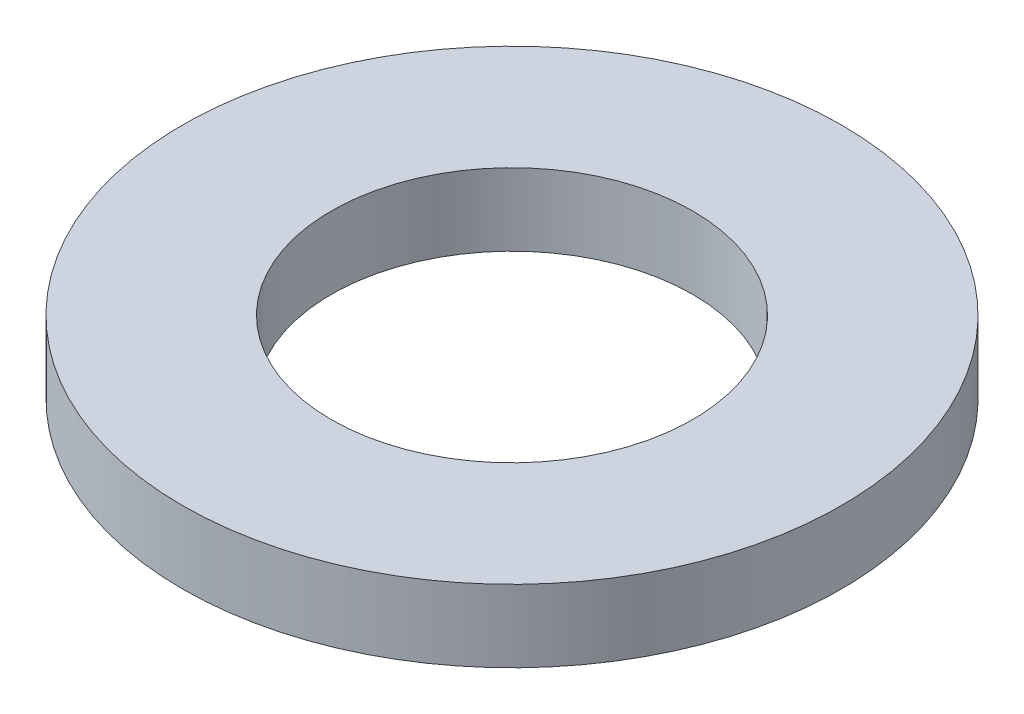
ISO-10303-21;
HEADER;
FILE_DESCRIPTION(('STEP AP214'),'2;1');
FILE_NAME('part.step','',(''),(''),'','','');
FILE_SCHEMA(('AUTOMOTIVE_DESIGN { 1 0 10303 214 1 1 1 1 }'));
ENDSEC;
DATA;
#1=APPLICATION_CONTEXT('core data for automotive mechanical design processes');
#2=APPLICATION_PROTOCOL_DEFINITION('international standard','automotive_design',2000,#1);
#3=PRODUCT_CONTEXT('',#1,'mechanical');
#4=PRODUCT('Part','Part','',(#3));
#5=PRODUCT_RELATED_PRODUCT_CATEGORY('part','',(#4));
#6=PRODUCT_DEFINITION_FORMATION('','',#4);
#7=PRODUCT_DEFINITION_CONTEXT('part definition',#1,'design');
#8=PRODUCT_DEFINITION('design','',#6,#7);
#9=PRODUCT_DEFINITION_SHAPE('','',#8);
#10=(LENGTH_UNIT() NAMED_UNIT(*) SI_UNIT(.MILLI.,.METRE.));
#11=(NAMED_UNIT(*) PLANE_ANGLE_UNIT() SI_UNIT($,.RADIAN.));
#12=(NAMED_UNIT(*) SI_UNIT($,.STERADIAN.) SOLID_ANGLE_UNIT());
#13=UNCERTAINTY_MEASURE_WITH_UNIT(LENGTH_MEASURE(1.E-05),#10,'distance_accuracy_value','');
#14=(GEOMETRIC_REPRESENTATION_CONTEXT(3) GLOBAL_UNCERTAINTY_ASSIGNED_CONTEXT((#13)) GLOBAL_UNIT_ASSIGNED_CONTEXT((#10,
#11,#12)) REPRESENTATION_CONTEXT('',''));
#15=CARTESIAN_POINT('',(0.,0.,0.));
#16=DIRECTION('',(0.,0.,1.));
#17=DIRECTION('',(1.,0.,0.));
#18=AXIS2_PLACEMENT_3D('',#15,#16,#17);
#19=CARTESIAN_POINT('',(0.,17.,0.));
#20=DIRECTION('',(0.,-1.,0.));
#21=DIRECTION('',(0.,0.,-1.));
#22=AXIS2_PLACEMENT_3D('',#19,#20,#21);
#23=CYLINDRICAL_SURFACE('',#22,77.5);
#24=CARTESIAN_POINT('',(0.,17.,0.));
#25=DIRECTION('',(0.,1.,0.));
#26=DIRECTION('',(0.,0.,1.));
#27=AXIS2_PLACEMENT_3D('',#24,#25,#26);
#28=CIRCLE('',#27,77.5);
#29=CARTESIAN_POINT('',(0.,17.,77.5));
#30=VERTEX_POINT('',#29);
#31=EDGE_CURVE('E10',#30,#30,#28,.T.);
#32=ORIENTED_EDGE('',*,*,#31,.F.);
#33=EDGE_LOOP('',(#32));
#34=FACE_BOUND('',#33,.T.);
#35=CARTESIAN_POINT('',(0.,0.,0.));
#36=DIRECTION('',(0.,1.,0.));
#37=DIRECTION('',(0.,0.,1.));
#38=AXIS2_PLACEMENT_3D('',#35,#36,#37);
#39=CIRCLE('',#38,77.5);
#40=CARTESIAN_POINT('',(0.,0.,77.5));
#41=VERTEX_POINT('',#40);
#42=EDGE_CURVE('E37',#41,#41,#39,.T.);
#43=ORIENTED_EDGE('',*,*,#42,.T.);
#44=EDGE_LOOP('',(#43));
#45=FACE_BOUND('',#44,.T.);
#46=ADVANCED_FACE('F40',(#34,#45),#23,.T.);
#47=CARTESIAN_POINT('',(0.,17.,0.));
#48=DIRECTION('',(0.,1.,0.));
#49=DIRECTION('',(0.,0.,1.));
#50=AXIS2_PLACEMENT_3D('',#47,#48,#49);
#51=PLANE('',#50);
#52=CARTESIAN_POINT('',(0.,17.,0.));
#53=DIRECTION('',(0.,1.,0.));
#54=DIRECTION('',(0.,0.,1.));
#55=AXIS2_PLACEMENT_3D('',#52,#53,#54);
#56=CIRCLE('',#55,42.5);
#57=CARTESIAN_POINT('',(0.,17.,42.5));
#58=VERTEX_POINT('',#57);
#59=EDGE_CURVE('E50',#58,#58,#56,.T.);
#60=ORIENTED_EDGE('',*,*,#59,.F.);
#61=EDGE_LOOP('',(#60));
#62=FACE_BOUND('',#61,.T.);
#63=ORIENTED_EDGE('',*,*,#31,.T.);
#64=EDGE_LOOP('',(#63));
#65=FACE_BOUND('',#64,.T.);
#66=ADVANCED_FACE('F59',(#62,#65),#51,.T.);
#67=CARTESIAN_POINT('',(0.,0.,0.));
#68=DIRECTION('',(0.,1.,0.));
#69=DIRECTION('',(0.,0.,1.));
#70=AXIS2_PLACEMENT_3D('',#67,#68,#69);
#71=PLANE('',#70);
#72=CARTESIAN_POINT('',(0.,0.,0.));
#73=DIRECTION('',(0.,1.,0.));
#74=DIRECTION('',(0.,0.,1.));
#75=AXIS2_PLACEMENT_3D('',#72,#73,#74);
#76=CIRCLE('',#75,42.5);
#77=CARTESIAN_POINT('',(0.,0.,42.5));
#78=VERTEX_POINT('',#77);
#79=EDGE_CURVE('E47',#78,#78,#76,.T.);
#80=ORIENTED_EDGE('',*,*,#79,.T.);
#81=EDGE_LOOP('',(#80));
#82=FACE_BOUND('',#81,.T.);
#83=ORIENTED_EDGE('',*,*,#42,.F.);
#84=EDGE_LOOP('',(#83));
#85=FACE_BOUND('',#84,.T.);
#86=ADVANCED_FACE('F58',(#82,#85),#71,.F.);
#87=CARTESIAN_POINT('',(0.,17.,0.));
#88=DIRECTION('',(0.,-1.,0.));
#89=DIRECTION('',(0.,0.,-1.));
#90=AXIS2_PLACEMENT_3D('',#87,#88,#89);
#91=CYLINDRICAL_SURFACE('',#90,42.5);
#92=ORIENTED_EDGE('',*,*,#59,.T.);
#93=EDGE_LOOP('',(#92));
#94=FACE_BOUND('',#93,.T.);
#95=ORIENTED_EDGE('',*,*,#79,.F.);
#96=EDGE_LOOP('',(#95));
#97=FACE_BOUND('',#96,.T.);
#98=ADVANCED_FACE('F54',(#94,#97),#91,.F.);
#99=CLOSED_SHELL('',(#46,#66,#86,#98));
#100=MANIFOLD_SOLID_BREP('B2',#99);
#101=ADVANCED_BREP_SHAPE_REPRESENTATION('',(#18,#100),#14);
#102=SHAPE_DEFINITION_REPRESENTATION(#9,#101);
ENDSEC;
END-ISO-10303-21;
